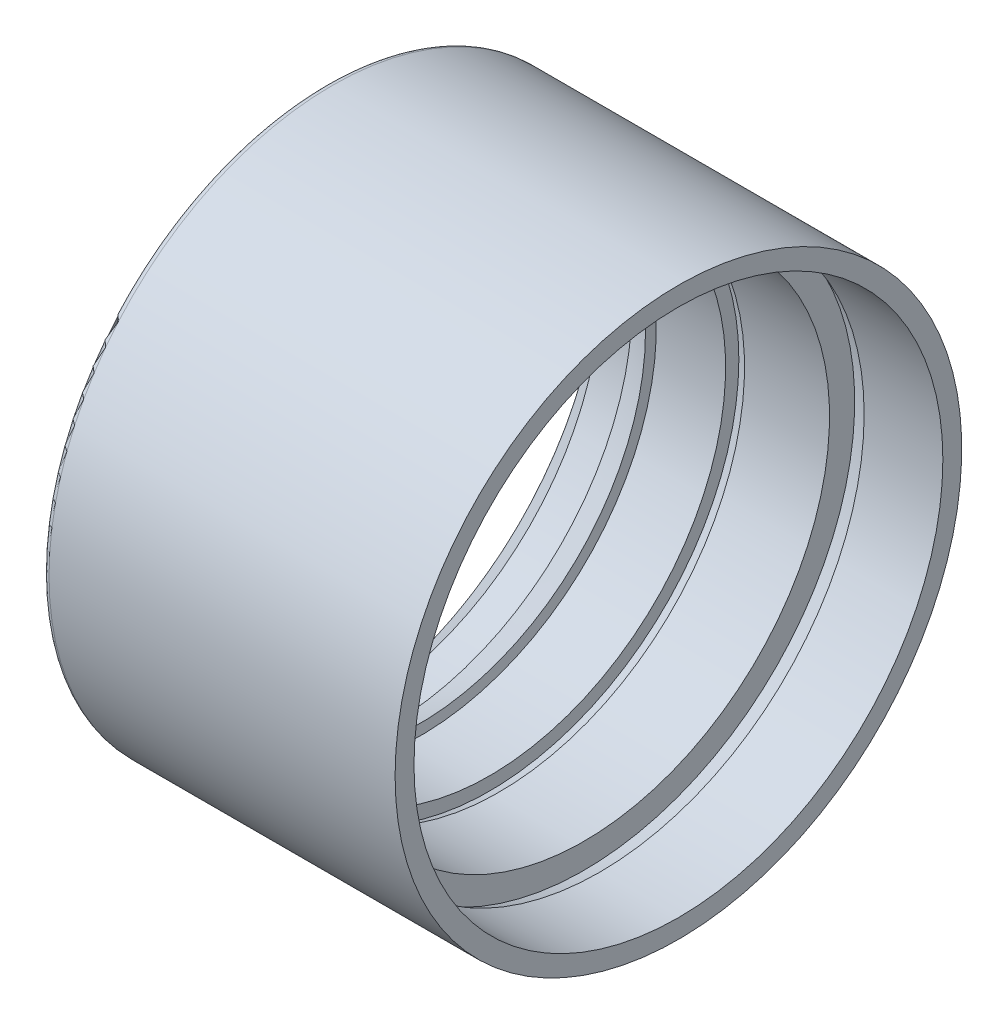
ISO-10303-21;
HEADER;
FILE_DESCRIPTION(('STEP AP214'),'2;1');
FILE_NAME('part.step','',(''),(''),'','','');
FILE_SCHEMA(('AUTOMOTIVE_DESIGN { 1 0 10303 214 1 1 1 1 }'));
ENDSEC;
DATA;
#1=APPLICATION_CONTEXT('core data for automotive mechanical design processes');
#2=APPLICATION_PROTOCOL_DEFINITION('international standard','automotive_design',2000,#1);
#3=PRODUCT_CONTEXT('',#1,'mechanical');
#4=PRODUCT('Part','Part','',(#3));
#5=PRODUCT_RELATED_PRODUCT_CATEGORY('part','',(#4));
#6=PRODUCT_DEFINITION_FORMATION('','',#4);
#7=PRODUCT_DEFINITION_CONTEXT('part definition',#1,'design');
#8=PRODUCT_DEFINITION('design','',#6,#7);
#9=PRODUCT_DEFINITION_SHAPE('','',#8);
#10=(LENGTH_UNIT() NAMED_UNIT(*) SI_UNIT(.MILLI.,.METRE.));
#11=(NAMED_UNIT(*) PLANE_ANGLE_UNIT() SI_UNIT($,.RADIAN.));
#12=(NAMED_UNIT(*) SI_UNIT($,.STERADIAN.) SOLID_ANGLE_UNIT());
#13=UNCERTAINTY_MEASURE_WITH_UNIT(LENGTH_MEASURE(1.E-05),#10,'distance_accuracy_value','');
#14=(GEOMETRIC_REPRESENTATION_CONTEXT(3) GLOBAL_UNCERTAINTY_ASSIGNED_CONTEXT((#13)) GLOBAL_UNIT_ASSIGNED_CONTEXT((#10,
#11,#12)) REPRESENTATION_CONTEXT('',''));
#15=CARTESIAN_POINT('',(0.,0.,0.));
#16=DIRECTION('',(0.,0.,1.));
#17=DIRECTION('',(1.,0.,0.));
#18=AXIS2_PLACEMENT_3D('',#15,#16,#17);
#19=CARTESIAN_POINT('',(202.124967866322,0.,0.));
#20=DIRECTION('',(-1.,0.,0.));
#21=DIRECTION('',(0.,1.,0.));
#22=AXIS2_PLACEMENT_3D('',#19,#20,#21);
#23=SPHERICAL_SURFACE('',#22,246.);
#24=CARTESIAN_POINT('',(-41.,0.,0.));
#25=DIRECTION('',(-1.,0.,0.));
#26=DIRECTION('',(0.,0.,1.));
#27=AXIS2_PLACEMENT_3D('',#24,#25,#26);
#28=CIRCLE('',#27,37.5);
#29=CARTESIAN_POINT('',(-41.,0.,37.5));
#30=VERTEX_POINT('',#29);
#31=EDGE_CURVE('E86',#30,#30,#28,.T.);
#32=ORIENTED_EDGE('',*,*,#31,.F.);
#33=EDGE_LOOP('',(#32));
#34=FACE_BOUND('',#33,.T.);
#35=CARTESIAN_POINT('',(-41.2266296217571,0.,0.));
#36=DIRECTION('',(-1.,0.,0.));
#37=DIRECTION('',(0.,0.,1.));
#38=AXIS2_PLACEMENT_3D('',#35,#36,#37);
#39=CIRCLE('',#38,36.);
#40=CARTESIAN_POINT('',(-41.2266296217571,0.,36.));
#41=VERTEX_POINT('',#40);
#42=EDGE_CURVE('E50',#41,#41,#39,.T.);
#43=ORIENTED_EDGE('',*,*,#42,.T.);
#44=EDGE_LOOP('',(#43));
#45=FACE_BOUND('',#44,.T.);
#46=ADVANCED_FACE('F39',(#34,#45),#23,.F.);
#47=CARTESIAN_POINT('',(-45.8750321336782,0.,0.));
#48=DIRECTION('',(-1.,0.,0.));
#49=DIRECTION('',(0.,0.,1.));
#50=AXIS2_PLACEMENT_3D('',#47,#48,#49);
#51=CONICAL_SURFACE('',#50,38.5,0.493443255709501);
#52=ORIENTED_EDGE('',*,*,#42,.F.);
#53=EDGE_LOOP('',(#52));
#54=FACE_BOUND('',#53,.T.);
#55=CARTESIAN_POINT('',(-45.8750321336782,0.,0.));
#56=DIRECTION('',(-1.,0.,0.));
#57=DIRECTION('',(0.,0.,1.));
#58=AXIS2_PLACEMENT_3D('',#55,#56,#57);
#59=CIRCLE('',#58,38.5);
#60=CARTESIAN_POINT('',(-45.8750321336782,0.,38.5));
#61=VERTEX_POINT('',#60);
#62=EDGE_CURVE('E54',#61,#61,#59,.T.);
#63=ORIENTED_EDGE('',*,*,#62,.T.);
#64=EDGE_LOOP('',(#63));
#65=FACE_BOUND('',#64,.T.);
#66=ADVANCED_FACE('F94',(#54,#65),#51,.F.);
#67=CARTESIAN_POINT('',(0.,0.,0.));
#68=DIRECTION('',(-1.,0.,0.));
#69=DIRECTION('',(0.,0.,1.));
#70=AXIS2_PLACEMENT_3D('',#67,#68,#69);
#71=CYLINDRICAL_SURFACE('',#70,38.5);
#72=ORIENTED_EDGE('',*,*,#62,.F.);
#73=EDGE_LOOP('',(#72));
#74=FACE_BOUND('',#73,.T.);
#75=CARTESIAN_POINT('',(-50.8750321336782,0.,0.));
#76=DIRECTION('',(-1.,0.,0.));
#77=DIRECTION('',(0.,0.,1.));
#78=AXIS2_PLACEMENT_3D('',#75,#76,#77);
#79=CIRCLE('',#78,38.5);
#80=CARTESIAN_POINT('',(-50.8750321336782,0.,38.5));
#81=VERTEX_POINT('',#80);
#82=EDGE_CURVE('E59',#81,#81,#79,.T.);
#83=ORIENTED_EDGE('',*,*,#82,.T.);
#84=EDGE_LOOP('',(#83));
#85=FACE_BOUND('',#84,.T.);
#86=ADVANCED_FACE('F99',(#74,#85),#71,.F.);
#87=CARTESIAN_POINT('',(-57.3750321336783,0.,0.));
#88=DIRECTION('',(-1.,0.,0.));
#89=DIRECTION('',(0.,0.,1.));
#90=AXIS2_PLACEMENT_3D('',#87,#88,#89);
#91=CONICAL_SURFACE('',#90,45.,0.785398163397442);
#92=CARTESIAN_POINT('',(-55.6679253524917,0.,0.));
#93=DIRECTION('',(1.,0.,0.));
#94=DIRECTION('',(0.,0.,-1.));
#95=AXIS2_PLACEMENT_3D('',#92,#93,#94);
#96=CIRCLE('',#95,43.2928932188134);
#97=CARTESIAN_POINT('',(-55.6679253524917,0.,-43.2928932188134));
#98=VERTEX_POINT('',#97);
#99=EDGE_CURVE('E46',#98,#98,#96,.F.);
#100=ORIENTED_EDGE('',*,*,#99,.T.);
#101=EDGE_LOOP('',(#100));
#102=FACE_BOUND('',#101,.T.);
#103=ORIENTED_EDGE('',*,*,#82,.F.);
#104=EDGE_LOOP('',(#103));
#105=FACE_BOUND('',#104,.T.);
#106=ADVANCED_FACE('F105',(#102,#105),#91,.F.);
#107=CARTESIAN_POINT('',(0.,0.,0.));
#108=DIRECTION('',(-1.,0.,0.));
#109=DIRECTION('',(0.,0.,1.));
#110=AXIS2_PLACEMENT_3D('',#107,#108,#109);
#111=CYLINDRICAL_SURFACE('',#110,45.);
#112=CARTESIAN_POINT('',(-54.9608185713051,0.,0.));
#113=DIRECTION('',(1.,0.,0.));
#114=DIRECTION('',(0.,0.,-1.));
#115=AXIS2_PLACEMENT_3D('',#112,#113,#114);
#116=CIRCLE('',#115,45.);
#117=CARTESIAN_POINT('',(-54.9608185713051,0.,-45.));
#118=VERTEX_POINT('',#117);
#119=EDGE_CURVE('E10',#118,#118,#116,.T.);
#120=ORIENTED_EDGE('',*,*,#119,.T.);
#121=EDGE_LOOP('',(#120));
#122=FACE_BOUND('',#121,.T.);
#123=CARTESIAN_POINT('',(0.,0.,0.));
#124=DIRECTION('',(-1.,0.,0.));
#125=DIRECTION('',(0.,0.,1.));
#126=AXIS2_PLACEMENT_3D('',#123,#124,#125);
#127=CIRCLE('',#126,45.);
#128=CARTESIAN_POINT('',(0.,0.,45.));
#129=VERTEX_POINT('',#128);
#130=EDGE_CURVE('E62',#129,#129,#127,.T.);
#131=ORIENTED_EDGE('',*,*,#130,.T.);
#132=EDGE_LOOP('',(#131));
#133=FACE_BOUND('',#132,.T.);
#134=ADVANCED_FACE('F110',(#122,#133),#111,.T.);
#135=CARTESIAN_POINT('',(0.,45.,0.));
#136=DIRECTION('',(-1.,0.,0.));
#137=DIRECTION('',(0.,0.,1.));
#138=AXIS2_PLACEMENT_3D('',#135,#136,#137);
#139=PLANE('',#138);
#140=ORIENTED_EDGE('',*,*,#130,.F.);
#141=EDGE_LOOP('',(#140));
#142=FACE_BOUND('',#141,.T.);
#143=CARTESIAN_POINT('',(0.,0.,0.));
#144=DIRECTION('',(-1.,0.,0.));
#145=DIRECTION('',(0.,0.,1.));
#146=AXIS2_PLACEMENT_3D('',#143,#144,#145);
#147=CIRCLE('',#146,42.);
#148=CARTESIAN_POINT('',(0.,0.,42.));
#149=VERTEX_POINT('',#148);
#150=EDGE_CURVE('E65',#149,#149,#147,.T.);
#151=ORIENTED_EDGE('',*,*,#150,.T.);
#152=EDGE_LOOP('',(#151));
#153=FACE_BOUND('',#152,.T.);
#154=ADVANCED_FACE('F115',(#142,#153),#139,.F.);
#155=CARTESIAN_POINT('',(0.,0.,0.));
#156=DIRECTION('',(-1.,0.,0.));
#157=DIRECTION('',(0.,0.,1.));
#158=AXIS2_PLACEMENT_3D('',#155,#156,#157);
#159=CYLINDRICAL_SURFACE('',#158,42.);
#160=ORIENTED_EDGE('',*,*,#150,.F.);
#161=EDGE_LOOP('',(#160));
#162=FACE_BOUND('',#161,.T.);
#163=CARTESIAN_POINT('',(-12.5,0.,0.));
#164=DIRECTION('',(-1.,0.,0.));
#165=DIRECTION('',(0.,0.,1.));
#166=AXIS2_PLACEMENT_3D('',#163,#164,#165);
#167=CIRCLE('',#166,42.);
#168=CARTESIAN_POINT('',(-12.5,0.,42.));
#169=VERTEX_POINT('',#168);
#170=EDGE_CURVE('E68',#169,#169,#167,.T.);
#171=ORIENTED_EDGE('',*,*,#170,.T.);
#172=EDGE_LOOP('',(#171));
#173=FACE_BOUND('',#172,.T.);
#174=ADVANCED_FACE('F120',(#162,#173),#159,.F.);
#175=CARTESIAN_POINT('',(-15.,0.,0.));
#176=DIRECTION('',(-1.,0.,0.));
#177=DIRECTION('',(0.,0.,1.));
#178=AXIS2_PLACEMENT_3D('',#175,#176,#177);
#179=CONICAL_SURFACE('',#178,43.,0.380506377112367);
#180=ORIENTED_EDGE('',*,*,#170,.F.);
#181=EDGE_LOOP('',(#180));
#182=FACE_BOUND('',#181,.T.);
#183=CARTESIAN_POINT('',(-15.,0.,0.));
#184=DIRECTION('',(-1.,0.,0.));
#185=DIRECTION('',(0.,0.,1.));
#186=AXIS2_PLACEMENT_3D('',#183,#184,#185);
#187=CIRCLE('',#186,43.);
#188=CARTESIAN_POINT('',(-15.,0.,43.));
#189=VERTEX_POINT('',#188);
#190=EDGE_CURVE('E71',#189,#189,#187,.T.);
#191=ORIENTED_EDGE('',*,*,#190,.T.);
#192=EDGE_LOOP('',(#191));
#193=FACE_BOUND('',#192,.T.);
#194=ADVANCED_FACE('F124',(#182,#193),#179,.F.);
#195=CARTESIAN_POINT('',(-15.,43.,0.));
#196=DIRECTION('',(-1.,0.,0.));
#197=DIRECTION('',(0.,0.,1.));
#198=AXIS2_PLACEMENT_3D('',#195,#196,#197);
#199=PLANE('',#198);
#200=ORIENTED_EDGE('',*,*,#190,.F.);
#201=EDGE_LOOP('',(#200));
#202=FACE_BOUND('',#201,.T.);
#203=CARTESIAN_POINT('',(-15.,0.,0.));
#204=DIRECTION('',(-1.,0.,0.));
#205=DIRECTION('',(0.,0.,1.));
#206=AXIS2_PLACEMENT_3D('',#203,#204,#205);
#207=CIRCLE('',#206,39.);
#208=CARTESIAN_POINT('',(-15.,0.,39.));
#209=VERTEX_POINT('',#208);
#210=EDGE_CURVE('E74',#209,#209,#207,.T.);
#211=ORIENTED_EDGE('',*,*,#210,.T.);
#212=EDGE_LOOP('',(#211));
#213=FACE_BOUND('',#212,.T.);
#214=ADVANCED_FACE('F128',(#202,#213),#199,.F.);
#215=CARTESIAN_POINT('',(0.,0.,0.));
#216=DIRECTION('',(-1.,0.,0.));
#217=DIRECTION('',(0.,0.,1.));
#218=AXIS2_PLACEMENT_3D('',#215,#216,#217);
#219=CYLINDRICAL_SURFACE('',#218,39.);
#220=ORIENTED_EDGE('',*,*,#210,.F.);
#221=EDGE_LOOP('',(#220));
#222=FACE_BOUND('',#221,.T.);
#223=CARTESIAN_POINT('',(-28.5,0.,0.));
#224=DIRECTION('',(-1.,0.,0.));
#225=DIRECTION('',(0.,0.,1.));
#226=AXIS2_PLACEMENT_3D('',#223,#224,#225);
#227=CIRCLE('',#226,39.);
#228=CARTESIAN_POINT('',(-28.5,0.,39.));
#229=VERTEX_POINT('',#228);
#230=EDGE_CURVE('E77',#229,#229,#227,.T.);
#231=ORIENTED_EDGE('',*,*,#230,.T.);
#232=EDGE_LOOP('',(#231));
#233=FACE_BOUND('',#232,.T.);
#234=ADVANCED_FACE('F132',(#222,#233),#219,.F.);
#235=CARTESIAN_POINT('',(-30.,0.,0.));
#236=DIRECTION('',(-1.,0.,0.));
#237=DIRECTION('',(0.,0.,1.));
#238=AXIS2_PLACEMENT_3D('',#235,#236,#237);
#239=CONICAL_SURFACE('',#238,39.6,0.380506377112366);
#240=ORIENTED_EDGE('',*,*,#230,.F.);
#241=EDGE_LOOP('',(#240));
#242=FACE_BOUND('',#241,.T.);
#243=CARTESIAN_POINT('',(-30.,0.,0.));
#244=DIRECTION('',(-1.,0.,0.));
#245=DIRECTION('',(0.,0.,1.));
#246=AXIS2_PLACEMENT_3D('',#243,#244,#245);
#247=CIRCLE('',#246,39.6);
#248=CARTESIAN_POINT('',(-30.,0.,39.6));
#249=VERTEX_POINT('',#248);
#250=EDGE_CURVE('E80',#249,#249,#247,.T.);
#251=ORIENTED_EDGE('',*,*,#250,.T.);
#252=EDGE_LOOP('',(#251));
#253=FACE_BOUND('',#252,.T.);
#254=ADVANCED_FACE('F136',(#242,#253),#239,.F.);
#255=CARTESIAN_POINT('',(-30.,39.6,0.));
#256=DIRECTION('',(-1.,0.,0.));
#257=DIRECTION('',(0.,0.,1.));
#258=AXIS2_PLACEMENT_3D('',#255,#256,#257);
#259=PLANE('',#258);
#260=ORIENTED_EDGE('',*,*,#250,.F.);
#261=EDGE_LOOP('',(#260));
#262=FACE_BOUND('',#261,.T.);
#263=CARTESIAN_POINT('',(-30.,0.,0.));
#264=DIRECTION('',(-1.,0.,0.));
#265=DIRECTION('',(0.,0.,1.));
#266=AXIS2_PLACEMENT_3D('',#263,#264,#265);
#267=CIRCLE('',#266,37.5);
#268=CARTESIAN_POINT('',(-30.,0.,37.5));
#269=VERTEX_POINT('',#268);
#270=EDGE_CURVE('E83',#269,#269,#267,.T.);
#271=ORIENTED_EDGE('',*,*,#270,.T.);
#272=EDGE_LOOP('',(#271));
#273=FACE_BOUND('',#272,.T.);
#274=ADVANCED_FACE('F140',(#262,#273),#259,.F.);
#275=CARTESIAN_POINT('',(0.,0.,0.));
#276=DIRECTION('',(-1.,0.,0.));
#277=DIRECTION('',(0.,0.,1.));
#278=AXIS2_PLACEMENT_3D('',#275,#276,#277);
#279=CYLINDRICAL_SURFACE('',#278,37.5);
#280=ORIENTED_EDGE('',*,*,#270,.F.);
#281=EDGE_LOOP('',(#280));
#282=FACE_BOUND('',#281,.T.);
#283=ORIENTED_EDGE('',*,*,#31,.T.);
#284=EDGE_LOOP('',(#283));
#285=FACE_BOUND('',#284,.T.);
#286=ADVANCED_FACE('F90',(#282,#285),#279,.F.);
#287=CARTESIAN_POINT('',(-54.9608185713051,0.,0.));
#288=DIRECTION('',(1.,0.,0.));
#289=DIRECTION('',(0.,0.,-1.));
#290=AXIS2_PLACEMENT_3D('',#287,#288,#289);
#291=TOROIDAL_SURFACE('',#290,44.,1.);
#292=ORIENTED_EDGE('',*,*,#119,.F.);
#293=EDGE_LOOP('',(#292));
#294=FACE_BOUND('',#293,.T.);
#295=ORIENTED_EDGE('',*,*,#99,.F.);
#296=EDGE_LOOP('',(#295));
#297=FACE_BOUND('',#296,.T.);
#298=ADVANCED_FACE('F41',(#294,#297),#291,.T.);
#299=CLOSED_SHELL('',(#46,#66,#86,#106,#134,#154,#174,#194,#214,#234,#254,#274,#286,#298));
#300=MANIFOLD_SOLID_BREP('B2',#299);
#301=ADVANCED_BREP_SHAPE_REPRESENTATION('',(#18,#300),#14);
#302=SHAPE_DEFINITION_REPRESENTATION(#9,#301);
ENDSEC;
END-ISO-10303-21;
